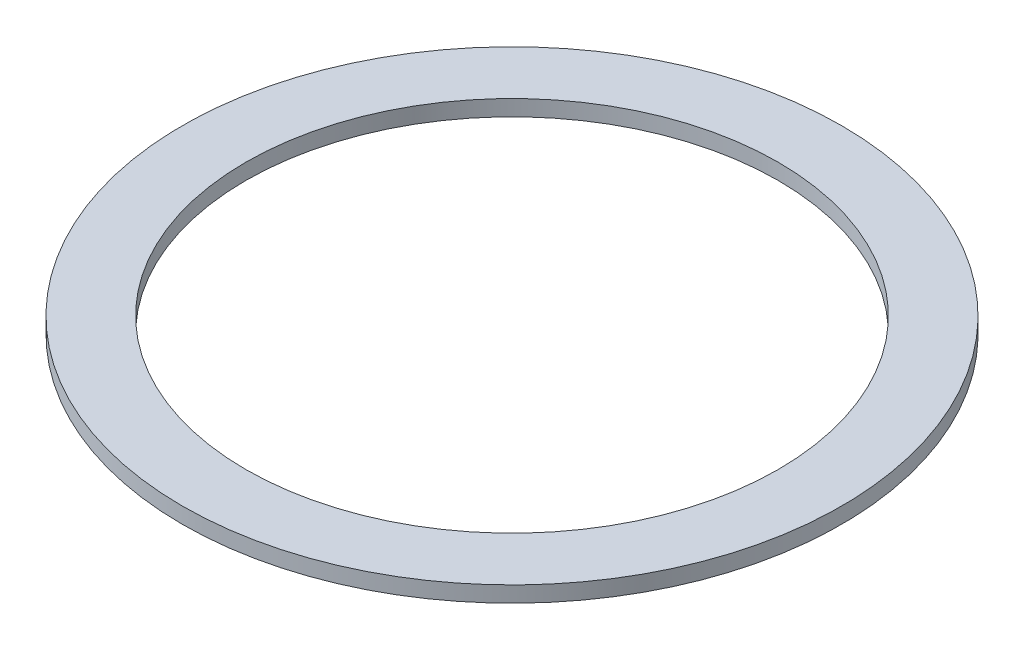
ISO-10303-21;
HEADER;
FILE_DESCRIPTION(('STEP AP214'),'2;1');
FILE_NAME('part.step','',(''),(''),'','','');
FILE_SCHEMA(('AUTOMOTIVE_DESIGN { 1 0 10303 214 1 1 1 1 }'));
ENDSEC;
DATA;
#1=APPLICATION_CONTEXT('core data for automotive mechanical design processes');
#2=APPLICATION_PROTOCOL_DEFINITION('international standard','automotive_design',2000,#1);
#3=PRODUCT_CONTEXT('',#1,'mechanical');
#4=PRODUCT('Part','Part','',(#3));
#5=PRODUCT_RELATED_PRODUCT_CATEGORY('part','',(#4));
#6=PRODUCT_DEFINITION_FORMATION('','',#4);
#7=PRODUCT_DEFINITION_CONTEXT('part definition',#1,'design');
#8=PRODUCT_DEFINITION('design','',#6,#7);
#9=PRODUCT_DEFINITION_SHAPE('','',#8);
#10=(LENGTH_UNIT() NAMED_UNIT(*) SI_UNIT(.MILLI.,.METRE.));
#11=(NAMED_UNIT(*) PLANE_ANGLE_UNIT() SI_UNIT($,.RADIAN.));
#12=(NAMED_UNIT(*) SI_UNIT($,.STERADIAN.) SOLID_ANGLE_UNIT());
#13=UNCERTAINTY_MEASURE_WITH_UNIT(LENGTH_MEASURE(1.E-05),#10,'distance_accuracy_value','');
#14=(GEOMETRIC_REPRESENTATION_CONTEXT(3) GLOBAL_UNCERTAINTY_ASSIGNED_CONTEXT((#13)) GLOBAL_UNIT_ASSIGNED_CONTEXT((#10,
#11,#12)) REPRESENTATION_CONTEXT('',''));
#15=CARTESIAN_POINT('',(0.,0.,0.));
#16=DIRECTION('',(0.,0.,1.));
#17=DIRECTION('',(1.,0.,0.));
#18=AXIS2_PLACEMENT_3D('',#15,#16,#17);
#19=CARTESIAN_POINT('',(0.,1.5875,0.));
#20=DIRECTION('',(0.,1.,0.));
#21=DIRECTION('',(0.,0.,1.));
#22=AXIS2_PLACEMENT_3D('',#19,#20,#21);
#23=PLANE('',#22);
#24=CARTESIAN_POINT('',(0.,1.5875,0.));
#25=DIRECTION('',(0.,1.,0.));
#26=DIRECTION('',(0.,0.,1.));
#27=AXIS2_PLACEMENT_3D('',#24,#25,#26);
#28=CIRCLE('',#27,33.02);
#29=CARTESIAN_POINT('',(0.,1.5875,33.02));
#30=VERTEX_POINT('',#29);
#31=EDGE_CURVE('E10',#30,#30,#28,.T.);
#32=ORIENTED_EDGE('',*,*,#31,.T.);
#33=EDGE_LOOP('',(#32));
#34=FACE_BOUND('',#33,.T.);
#35=CARTESIAN_POINT('',(0.,1.5875,0.));
#36=DIRECTION('',(0.,1.,0.));
#37=DIRECTION('',(0.,0.,1.));
#38=AXIS2_PLACEMENT_3D('',#35,#36,#37);
#39=CIRCLE('',#38,26.67);
#40=CARTESIAN_POINT('',(0.,1.5875,26.67));
#41=VERTEX_POINT('',#40);
#42=EDGE_CURVE('E58',#41,#41,#39,.T.);
#43=ORIENTED_EDGE('',*,*,#42,.F.);
#44=EDGE_LOOP('',(#43));
#45=FACE_BOUND('',#44,.T.);
#46=ADVANCED_FACE('F45',(#34,#45),#23,.T.);
#47=CARTESIAN_POINT('',(0.,0.,0.));
#48=DIRECTION('',(0.,1.,0.));
#49=DIRECTION('',(0.,0.,1.));
#50=AXIS2_PLACEMENT_3D('',#47,#48,#49);
#51=PLANE('',#50);
#52=CARTESIAN_POINT('',(0.,0.,0.));
#53=DIRECTION('',(0.,1.,0.));
#54=DIRECTION('',(0.,0.,1.));
#55=AXIS2_PLACEMENT_3D('',#52,#53,#54);
#56=CIRCLE('',#55,33.02);
#57=CARTESIAN_POINT('',(0.,0.,33.02));
#58=VERTEX_POINT('',#57);
#59=EDGE_CURVE('E49',#58,#58,#56,.T.);
#60=ORIENTED_EDGE('',*,*,#59,.F.);
#61=EDGE_LOOP('',(#60));
#62=FACE_BOUND('',#61,.T.);
#63=CARTESIAN_POINT('',(0.,0.,0.));
#64=DIRECTION('',(0.,1.,0.));
#65=DIRECTION('',(0.,0.,1.));
#66=AXIS2_PLACEMENT_3D('',#63,#64,#65);
#67=CIRCLE('',#66,26.67);
#68=CARTESIAN_POINT('',(0.,0.,26.67));
#69=VERTEX_POINT('',#68);
#70=EDGE_CURVE('E60',#69,#69,#67,.T.);
#71=ORIENTED_EDGE('',*,*,#70,.T.);
#72=EDGE_LOOP('',(#71));
#73=FACE_BOUND('',#72,.T.);
#74=ADVANCED_FACE('F72',(#62,#73),#51,.F.);
#75=CARTESIAN_POINT('',(0.,1.5875,0.));
#76=DIRECTION('',(0.,-1.,0.));
#77=DIRECTION('',(0.,0.,-1.));
#78=AXIS2_PLACEMENT_3D('',#75,#76,#77);
#79=CYLINDRICAL_SURFACE('',#78,33.02);
#80=ORIENTED_EDGE('',*,*,#31,.F.);
#81=EDGE_LOOP('',(#80));
#82=FACE_BOUND('',#81,.T.);
#83=ORIENTED_EDGE('',*,*,#59,.T.);
#84=EDGE_LOOP('',(#83));
#85=FACE_BOUND('',#84,.T.);
#86=ADVANCED_FACE('F47',(#82,#85),#79,.T.);
#87=CARTESIAN_POINT('',(0.,1.5875,0.));
#88=DIRECTION('',(0.,-1.,0.));
#89=DIRECTION('',(0.,0.,-1.));
#90=AXIS2_PLACEMENT_3D('',#87,#88,#89);
#91=CYLINDRICAL_SURFACE('',#90,26.67);
#92=ORIENTED_EDGE('',*,*,#42,.T.);
#93=EDGE_LOOP('',(#92));
#94=FACE_BOUND('',#93,.T.);
#95=ORIENTED_EDGE('',*,*,#70,.F.);
#96=EDGE_LOOP('',(#95));
#97=FACE_BOUND('',#96,.T.);
#98=ADVANCED_FACE('F68',(#94,#97),#91,.F.);
#99=CLOSED_SHELL('',(#46,#74,#86,#98));
#100=MANIFOLD_SOLID_BREP('B2',#99);
#101=ADVANCED_BREP_SHAPE_REPRESENTATION('',(#18,#100),#14);
#102=SHAPE_DEFINITION_REPRESENTATION(#9,#101);
ENDSEC;
END-ISO-10303-21;
